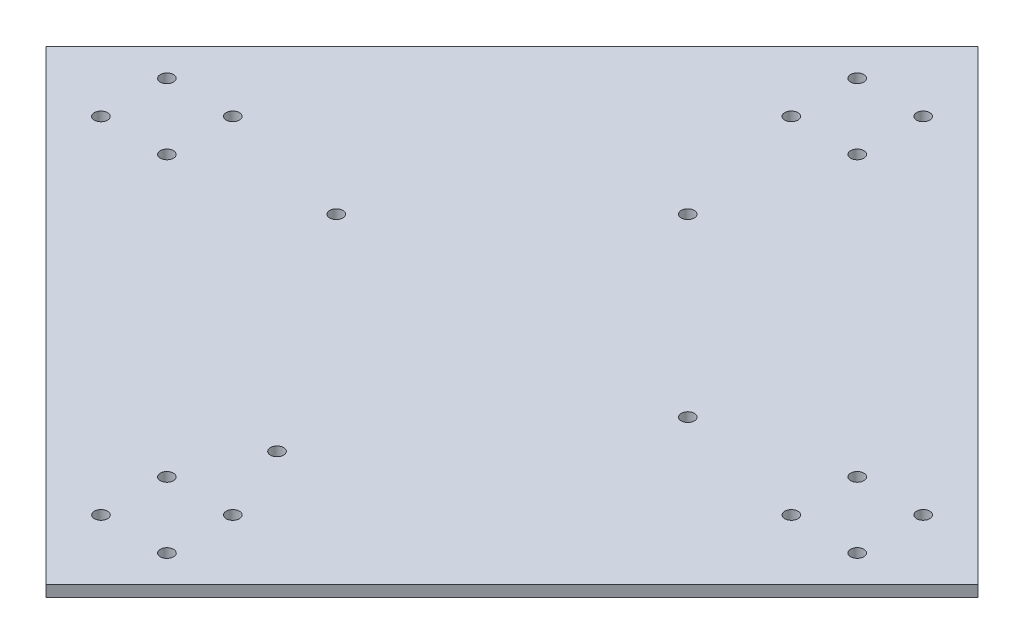
ISO-10303-21;
HEADER;
FILE_DESCRIPTION(('STEP AP214'),'2;1');
FILE_NAME('part.step','',(''),(''),'','','');
FILE_SCHEMA(('AUTOMOTIVE_DESIGN { 1 0 10303 214 1 1 1 1 }'));
ENDSEC;
DATA;
#1=APPLICATION_CONTEXT('core data for automotive mechanical design processes');
#2=APPLICATION_PROTOCOL_DEFINITION('international standard','automotive_design',2000,#1);
#3=PRODUCT_CONTEXT('',#1,'mechanical');
#4=PRODUCT('Part','Part','',(#3));
#5=PRODUCT_RELATED_PRODUCT_CATEGORY('part','',(#4));
#6=PRODUCT_DEFINITION_FORMATION('','',#4);
#7=PRODUCT_DEFINITION_CONTEXT('part definition',#1,'design');
#8=PRODUCT_DEFINITION('design','',#6,#7);
#9=PRODUCT_DEFINITION_SHAPE('','',#8);
#10=(LENGTH_UNIT() NAMED_UNIT(*) SI_UNIT(.MILLI.,.METRE.));
#11=(NAMED_UNIT(*) PLANE_ANGLE_UNIT() SI_UNIT($,.RADIAN.));
#12=(NAMED_UNIT(*) SI_UNIT($,.STERADIAN.) SOLID_ANGLE_UNIT());
#13=UNCERTAINTY_MEASURE_WITH_UNIT(LENGTH_MEASURE(1.E-05),#10,'distance_accuracy_value','');
#14=(GEOMETRIC_REPRESENTATION_CONTEXT(3) GLOBAL_UNCERTAINTY_ASSIGNED_CONTEXT((#13)) GLOBAL_UNIT_ASSIGNED_CONTEXT((#10,
#11,#12)) REPRESENTATION_CONTEXT('',''));
#15=CARTESIAN_POINT('',(0.,0.,0.));
#16=DIRECTION('',(0.,0.,1.));
#17=DIRECTION('',(1.,0.,0.));
#18=AXIS2_PLACEMENT_3D('',#15,#16,#17);
#19=CARTESIAN_POINT('',(94506.6112620316,1251.25,-82102.2476133017));
#20=DIRECTION('',(0.707106781186548,0.,-0.707106781186548));
#21=DIRECTION('',(-0.707106781186548,0.,-0.707106781186548));
#22=AXIS2_PLACEMENT_3D('',#19,#20,#21);
#23=PLANE('',#22);
#24=DIRECTION('',(0.707106781186548,0.,0.707106781186548));
#25=VECTOR('',#24,1.);
#26=CARTESIAN_POINT('',(94506.6112620316,1248.75,-82102.2476133017));
#27=LINE('',#26,#25);
#28=CARTESIAN_POINT('',(94459.7851015823,1248.75,-82149.073773751));
#29=VERTEX_POINT('',#28);
#30=CARTESIAN_POINT('',(94565.8511187603,1248.75,-82043.007756573));
#31=VERTEX_POINT('',#30);
#32=EDGE_CURVE('E182',#29,#31,#27,.T.);
#33=ORIENTED_EDGE('',*,*,#32,.F.);
#34=DIRECTION('',(0.,-1.,0.));
#35=VECTOR('',#34,1.);
#36=CARTESIAN_POINT('',(94459.7851015823,1251.25,-82149.073773751));
#37=LINE('',#36,#35);
#38=CARTESIAN_POINT('',(94459.7851015823,1251.25,-82149.073773751));
#39=VERTEX_POINT('',#38);
#40=EDGE_CURVE('E11',#39,#29,#37,.T.);
#41=ORIENTED_EDGE('',*,*,#40,.F.);
#42=DIRECTION('',(0.707106781186548,0.,0.707106781186548));
#43=VECTOR('',#42,1.);
#44=CARTESIAN_POINT('',(94506.6112620316,1251.25,-82102.2476133017));
#45=LINE('',#44,#43);
#46=CARTESIAN_POINT('',(94565.8511187603,1251.25,-82043.007756573));
#47=VERTEX_POINT('',#46);
#48=EDGE_CURVE('E108',#39,#47,#45,.T.);
#49=ORIENTED_EDGE('',*,*,#48,.T.);
#50=DIRECTION('',(0.,-1.,0.));
#51=VECTOR('',#50,1.);
#52=CARTESIAN_POINT('',(94565.8511187603,1251.25,-82043.007756573));
#53=LINE('',#52,#51);
#54=EDGE_CURVE('E84',#47,#31,#53,.T.);
#55=ORIENTED_EDGE('',*,*,#54,.T.);
#56=EDGE_LOOP('',(#33,#41,#49,#55));
#57=FACE_BOUND('',#56,.T.);
#58=ADVANCED_FACE('F41',(#57),#23,.T.);
#59=CARTESIAN_POINT('',(94318.5015494397,1251.25,-82007.7902188667));
#60=DIRECTION('',(-0.707106788047674,0.,-0.707106774325421));
#61=DIRECTION('',(-0.707106774325421,0.,0.707106788047674));
#62=AXIS2_PLACEMENT_3D('',#59,#60,#61);
#63=PLANE('',#62);
#64=DIRECTION('',(0.707106774325421,0.,-0.707106788047674));
#65=VECTOR('',#64,1.);
#66=CARTESIAN_POINT('',(94318.5015494397,1248.75,-82007.7902188667));
#67=LINE('',#66,#65);
#68=CARTESIAN_POINT('',(94353.7190864626,1248.75,-82043.007756573));
#69=VERTEX_POINT('',#68);
#70=EDGE_CURVE('E96',#69,#29,#67,.T.);
#71=ORIENTED_EDGE('',*,*,#70,.F.);
#72=DIRECTION('',(0.,-1.,0.));
#73=VECTOR('',#72,1.);
#74=CARTESIAN_POINT('',(94353.7190864626,1251.25,-82043.007756573));
#75=LINE('',#74,#73);
#76=CARTESIAN_POINT('',(94353.7190864626,1251.25,-82043.007756573));
#77=VERTEX_POINT('',#76);
#78=EDGE_CURVE('E52',#77,#69,#75,.T.);
#79=ORIENTED_EDGE('',*,*,#78,.F.);
#80=DIRECTION('',(0.707106774325421,0.,-0.707106788047674));
#81=VECTOR('',#80,1.);
#82=CARTESIAN_POINT('',(94318.5015494397,1251.25,-82007.7902188667));
#83=LINE('',#82,#81);
#84=EDGE_CURVE('E94',#77,#39,#83,.T.);
#85=ORIENTED_EDGE('',*,*,#84,.T.);
#86=ORIENTED_EDGE('',*,*,#40,.T.);
#87=EDGE_LOOP('',(#71,#79,#85,#86));
#88=FACE_BOUND('',#87,.T.);
#89=ADVANCED_FACE('F92',(#88),#63,.T.);
#90=CARTESIAN_POINT('',(94400.5452458827,1251.25,-81996.1815971529));
#91=DIRECTION('',(0.707106781186548,0.,-0.707106781186548));
#92=DIRECTION('',(-0.707106781186548,0.,-0.707106781186548));
#93=AXIS2_PLACEMENT_3D('',#90,#91,#92);
#94=PLANE('',#93);
#95=DIRECTION('',(0.707106781186548,0.,0.707106781186548));
#96=VECTOR('',#95,1.);
#97=CARTESIAN_POINT('',(94400.5452458827,1248.75,-81996.1815971529));
#98=LINE('',#97,#96);
#99=CARTESIAN_POINT('',(94459.7998782573,1248.75,-81936.9269647783));
#100=VERTEX_POINT('',#99);
#101=EDGE_CURVE('E187',#69,#100,#98,.T.);
#102=ORIENTED_EDGE('',*,*,#101,.T.);
#103=DIRECTION('',(0.,-1.,0.));
#104=VECTOR('',#103,1.);
#105=CARTESIAN_POINT('',(94459.7998782573,1251.25,-81936.9269647783));
#106=LINE('',#105,#104);
#107=CARTESIAN_POINT('',(94459.7998782573,1251.25,-81936.9269647783));
#108=VERTEX_POINT('',#107);
#109=EDGE_CURVE('E100',#108,#100,#106,.T.);
#110=ORIENTED_EDGE('',*,*,#109,.F.);
#111=DIRECTION('',(0.707106781186548,0.,0.707106781186548));
#112=VECTOR('',#111,1.);
#113=CARTESIAN_POINT('',(94400.5452458827,1251.25,-81996.1815971529));
#114=LINE('',#113,#112);
#115=EDGE_CURVE('E103',#77,#108,#114,.T.);
#116=ORIENTED_EDGE('',*,*,#115,.F.);
#117=ORIENTED_EDGE('',*,*,#78,.T.);
#118=EDGE_LOOP('',(#102,#110,#116,#117));
#119=FACE_BOUND('',#118,.T.);
#120=ADVANCED_FACE('F104',(#119),#94,.F.);
#121=CARTESIAN_POINT('',(94452.2851036406,1251.25,-82129.073773751));
#122=DIRECTION('',(0.,-1.,0.));
#123=DIRECTION('',(0.,0.,-1.));
#124=AXIS2_PLACEMENT_3D('',#121,#122,#123);
#125=CYLINDRICAL_SURFACE('',#124,1.49999999999997);
#126=CARTESIAN_POINT('',(94452.2851036406,1251.25,-82129.073773751));
#127=DIRECTION('',(0.,1.,0.));
#128=DIRECTION('',(0.,0.,1.));
#129=AXIS2_PLACEMENT_3D('',#126,#127,#128);
#130=CIRCLE('',#129,1.49999999999997);
#131=CARTESIAN_POINT('',(94452.2851036406,1251.25,-82127.573773751));
#132=VERTEX_POINT('',#131);
#133=EDGE_CURVE('E112',#132,#132,#130,.T.);
#134=ORIENTED_EDGE('',*,*,#133,.T.);
#135=EDGE_LOOP('',(#134));
#136=FACE_BOUND('',#135,.T.);
#137=CARTESIAN_POINT('',(94452.2851036406,1248.75,-82129.073773751));
#138=DIRECTION('',(0.,1.,0.));
#139=DIRECTION('',(0.,0.,1.));
#140=AXIS2_PLACEMENT_3D('',#137,#138,#139);
#141=CIRCLE('',#140,1.49999999999997);
#142=CARTESIAN_POINT('',(94452.2851036406,1248.75,-82127.573773751));
#143=VERTEX_POINT('',#142);
#144=EDGE_CURVE('E178',#143,#143,#141,.T.);
#145=ORIENTED_EDGE('',*,*,#144,.F.);
#146=EDGE_LOOP('',(#145));
#147=FACE_BOUND('',#146,.T.);
#148=ADVANCED_FACE('F236',(#136,#147),#125,.F.);
#149=CARTESIAN_POINT('',(94467.2998782573,1251.25,-82129.073773751));
#150=DIRECTION('',(0.,-1.,0.));
#151=DIRECTION('',(0.,0.,-1.));
#152=AXIS2_PLACEMENT_3D('',#149,#150,#151);
#153=CYLINDRICAL_SURFACE('',#152,1.49999999999997);
#154=CARTESIAN_POINT('',(94467.2998782573,1251.25,-82129.073773751));
#155=DIRECTION('',(0.,1.,0.));
#156=DIRECTION('',(0.,0.,1.));
#157=AXIS2_PLACEMENT_3D('',#154,#155,#156);
#158=CIRCLE('',#157,1.49999999999997);
#159=CARTESIAN_POINT('',(94467.2998782573,1251.25,-82127.573773751));
#160=VERTEX_POINT('',#159);
#161=EDGE_CURVE('E555',#160,#160,#158,.T.);
#162=ORIENTED_EDGE('',*,*,#161,.T.);
#163=EDGE_LOOP('',(#162));
#164=FACE_BOUND('',#163,.T.);
#165=CARTESIAN_POINT('',(94467.2998782573,1248.75,-82129.073773751));
#166=DIRECTION('',(0.,1.,0.));
#167=DIRECTION('',(0.,0.,1.));
#168=AXIS2_PLACEMENT_3D('',#165,#166,#167);
#169=CIRCLE('',#168,1.49999999999997);
#170=CARTESIAN_POINT('',(94467.2998782573,1248.75,-82127.573773751));
#171=VERTEX_POINT('',#170);
#172=EDGE_CURVE('E174',#171,#171,#169,.T.);
#173=ORIENTED_EDGE('',*,*,#172,.F.);
#174=EDGE_LOOP('',(#173));
#175=FACE_BOUND('',#174,.T.);
#176=ADVANCED_FACE('F239',(#164,#175),#153,.F.);
#177=CARTESIAN_POINT('',(94467.2998782573,1251.25,-82114.073773751));
#178=DIRECTION('',(0.,-1.,0.));
#179=DIRECTION('',(0.,0.,-1.));
#180=AXIS2_PLACEMENT_3D('',#177,#178,#179);
#181=CYLINDRICAL_SURFACE('',#180,1.49999999999997);
#182=CARTESIAN_POINT('',(94467.2998782573,1251.25,-82114.073773751));
#183=DIRECTION('',(0.,1.,0.));
#184=DIRECTION('',(0.,0.,1.));
#185=AXIS2_PLACEMENT_3D('',#182,#183,#184);
#186=CIRCLE('',#185,1.49999999999997);
#187=CARTESIAN_POINT('',(94467.2998782573,1251.25,-82112.573773751));
#188=VERTEX_POINT('',#187);
#189=EDGE_CURVE('E551',#188,#188,#186,.T.);
#190=ORIENTED_EDGE('',*,*,#189,.T.);
#191=EDGE_LOOP('',(#190));
#192=FACE_BOUND('',#191,.T.);
#193=CARTESIAN_POINT('',(94467.2998782573,1248.75,-82114.073773751));
#194=DIRECTION('',(0.,1.,0.));
#195=DIRECTION('',(0.,0.,1.));
#196=AXIS2_PLACEMENT_3D('',#193,#194,#195);
#197=CIRCLE('',#196,1.49999999999997);
#198=CARTESIAN_POINT('',(94467.2998782573,1248.75,-82112.573773751));
#199=VERTEX_POINT('',#198);
#200=EDGE_CURVE('E170',#199,#199,#197,.T.);
#201=ORIENTED_EDGE('',*,*,#200,.F.);
#202=EDGE_LOOP('',(#201));
#203=FACE_BOUND('',#202,.T.);
#204=ADVANCED_FACE('F243',(#192,#203),#181,.F.);
#205=CARTESIAN_POINT('',(94452.2998782573,1251.25,-82114.073773751));
#206=DIRECTION('',(0.,-1.,0.));
#207=DIRECTION('',(0.,0.,-1.));
#208=AXIS2_PLACEMENT_3D('',#205,#206,#207);
#209=CYLINDRICAL_SURFACE('',#208,1.49999999999997);
#210=CARTESIAN_POINT('',(94452.2998782573,1251.25,-82114.073773751));
#211=DIRECTION('',(0.,1.,0.));
#212=DIRECTION('',(0.,0.,1.));
#213=AXIS2_PLACEMENT_3D('',#210,#211,#212);
#214=CIRCLE('',#213,1.49999999999997);
#215=CARTESIAN_POINT('',(94452.2998782573,1251.25,-82112.573773751));
#216=VERTEX_POINT('',#215);
#217=EDGE_CURVE('E547',#216,#216,#214,.T.);
#218=ORIENTED_EDGE('',*,*,#217,.T.);
#219=EDGE_LOOP('',(#218));
#220=FACE_BOUND('',#219,.T.);
#221=CARTESIAN_POINT('',(94452.2998782573,1248.75,-82114.073773751));
#222=DIRECTION('',(0.,1.,0.));
#223=DIRECTION('',(0.,0.,1.));
#224=AXIS2_PLACEMENT_3D('',#221,#222,#223);
#225=CIRCLE('',#224,1.49999999999997);
#226=CARTESIAN_POINT('',(94452.2998782573,1248.75,-82112.573773751));
#227=VERTEX_POINT('',#226);
#228=EDGE_CURVE('E166',#227,#227,#225,.T.);
#229=ORIENTED_EDGE('',*,*,#228,.F.);
#230=EDGE_LOOP('',(#229));
#231=FACE_BOUND('',#230,.T.);
#232=ADVANCED_FACE('F247',(#220,#231),#209,.F.);
#233=CARTESIAN_POINT('',(94530.8658954353,1251.25,-82035.507756573));
#234=DIRECTION('',(0.,-1.,0.));
#235=DIRECTION('',(0.,0.,-1.));
#236=AXIS2_PLACEMENT_3D('',#233,#234,#235);
#237=CYLINDRICAL_SURFACE('',#236,1.49999999999997);
#238=CARTESIAN_POINT('',(94530.8658954353,1251.25,-82035.507756573));
#239=DIRECTION('',(0.,1.,0.));
#240=DIRECTION('',(0.,0.,1.));
#241=AXIS2_PLACEMENT_3D('',#238,#239,#240);
#242=CIRCLE('',#241,1.49999999999997);
#243=CARTESIAN_POINT('',(94530.8658954353,1251.25,-82034.007756573));
#244=VERTEX_POINT('',#243);
#245=EDGE_CURVE('E543',#244,#244,#242,.T.);
#246=ORIENTED_EDGE('',*,*,#245,.T.);
#247=EDGE_LOOP('',(#246));
#248=FACE_BOUND('',#247,.T.);
#249=CARTESIAN_POINT('',(94530.8658954353,1248.75,-82035.507756573));
#250=DIRECTION('',(0.,1.,0.));
#251=DIRECTION('',(0.,0.,1.));
#252=AXIS2_PLACEMENT_3D('',#249,#250,#251);
#253=CIRCLE('',#252,1.49999999999997);
#254=CARTESIAN_POINT('',(94530.8658954353,1248.75,-82034.007756573));
#255=VERTEX_POINT('',#254);
#256=EDGE_CURVE('E162',#255,#255,#253,.T.);
#257=ORIENTED_EDGE('',*,*,#256,.F.);
#258=EDGE_LOOP('',(#257));
#259=FACE_BOUND('',#258,.T.);
#260=ADVANCED_FACE('F251',(#248,#259),#237,.F.);
#261=CARTESIAN_POINT('',(94452.2998782573,1251.25,-81971.941739395));
#262=DIRECTION('',(0.,-1.,0.));
#263=DIRECTION('',(0.,0.,-1.));
#264=AXIS2_PLACEMENT_3D('',#261,#262,#263);
#265=CYLINDRICAL_SURFACE('',#264,1.49999999999997);
#266=CARTESIAN_POINT('',(94452.2998782573,1251.25,-81971.941739395));
#267=DIRECTION('',(0.,1.,0.));
#268=DIRECTION('',(0.,0.,1.));
#269=AXIS2_PLACEMENT_3D('',#266,#267,#268);
#270=CIRCLE('',#269,1.49999999999997);
#271=CARTESIAN_POINT('',(94452.2998782573,1251.25,-81970.441739395));
#272=VERTEX_POINT('',#271);
#273=EDGE_CURVE('E539',#272,#272,#270,.T.);
#274=ORIENTED_EDGE('',*,*,#273,.T.);
#275=EDGE_LOOP('',(#274));
#276=FACE_BOUND('',#275,.T.);
#277=CARTESIAN_POINT('',(94452.2998782573,1248.75,-81971.941739395));
#278=DIRECTION('',(0.,1.,0.));
#279=DIRECTION('',(0.,0.,1.));
#280=AXIS2_PLACEMENT_3D('',#277,#278,#279);
#281=CIRCLE('',#280,1.49999999999997);
#282=CARTESIAN_POINT('',(94452.2998782573,1248.75,-81970.441739395));
#283=VERTEX_POINT('',#282);
#284=EDGE_CURVE('E158',#283,#283,#281,.T.);
#285=ORIENTED_EDGE('',*,*,#284,.F.);
#286=EDGE_LOOP('',(#285));
#287=FACE_BOUND('',#286,.T.);
#288=ADVANCED_FACE('F255',(#276,#287),#265,.F.);
#289=CARTESIAN_POINT('',(94388.7338610794,1251.25,-82050.507756573));
#290=DIRECTION('',(0.,-1.,0.));
#291=DIRECTION('',(0.,0.,-1.));
#292=AXIS2_PLACEMENT_3D('',#289,#290,#291);
#293=CYLINDRICAL_SURFACE('',#292,1.49999999999997);
#294=CARTESIAN_POINT('',(94388.7338610794,1251.25,-82050.507756573));
#295=DIRECTION('',(0.,1.,0.));
#296=DIRECTION('',(0.,0.,1.));
#297=AXIS2_PLACEMENT_3D('',#294,#295,#296);
#298=CIRCLE('',#297,1.49999999999997);
#299=CARTESIAN_POINT('',(94388.7338610794,1251.25,-82049.007756573));
#300=VERTEX_POINT('',#299);
#301=EDGE_CURVE('E535',#300,#300,#298,.T.);
#302=ORIENTED_EDGE('',*,*,#301,.T.);
#303=EDGE_LOOP('',(#302));
#304=FACE_BOUND('',#303,.T.);
#305=CARTESIAN_POINT('',(94388.7338610794,1248.75,-82050.507756573));
#306=DIRECTION('',(0.,1.,0.));
#307=DIRECTION('',(0.,0.,1.));
#308=AXIS2_PLACEMENT_3D('',#305,#306,#307);
#309=CIRCLE('',#308,1.49999999999997);
#310=CARTESIAN_POINT('',(94388.7338610794,1248.75,-82049.007756573));
#311=VERTEX_POINT('',#310);
#312=EDGE_CURVE('E154',#311,#311,#309,.T.);
#313=ORIENTED_EDGE('',*,*,#312,.F.);
#314=EDGE_LOOP('',(#313));
#315=FACE_BOUND('',#314,.T.);
#316=ADVANCED_FACE('F259',(#304,#315),#293,.F.);
#317=CARTESIAN_POINT('',(94545.8658954353,1251.25,-82050.5225311897));
#318=DIRECTION('',(0.,-1.,0.));
#319=DIRECTION('',(0.,0.,-1.));
#320=AXIS2_PLACEMENT_3D('',#317,#318,#319);
#321=CYLINDRICAL_SURFACE('',#320,1.49999999999997);
#322=CARTESIAN_POINT('',(94545.8658954353,1251.25,-82050.5225311897));
#323=DIRECTION('',(0.,1.,0.));
#324=DIRECTION('',(0.,0.,1.));
#325=AXIS2_PLACEMENT_3D('',#322,#323,#324);
#326=CIRCLE('',#325,1.49999999999997);
#327=CARTESIAN_POINT('',(94545.8658954353,1251.25,-82049.0225311898));
#328=VERTEX_POINT('',#327);
#329=EDGE_CURVE('E531',#328,#328,#326,.T.);
#330=ORIENTED_EDGE('',*,*,#329,.T.);
#331=EDGE_LOOP('',(#330));
#332=FACE_BOUND('',#331,.T.);
#333=CARTESIAN_POINT('',(94545.8658954353,1248.75,-82050.5225311897));
#334=DIRECTION('',(0.,1.,0.));
#335=DIRECTION('',(0.,0.,1.));
#336=AXIS2_PLACEMENT_3D('',#333,#334,#335);
#337=CIRCLE('',#336,1.49999999999997);
#338=CARTESIAN_POINT('',(94545.8658954353,1248.75,-82049.0225311898));
#339=VERTEX_POINT('',#338);
#340=EDGE_CURVE('E150',#339,#339,#337,.T.);
#341=ORIENTED_EDGE('',*,*,#340,.F.);
#342=EDGE_LOOP('',(#341));
#343=FACE_BOUND('',#342,.T.);
#344=ADVANCED_FACE('F263',(#332,#343),#321,.F.);
#345=CARTESIAN_POINT('',(94545.8658954353,1251.25,-82035.507756573));
#346=DIRECTION('',(0.,-1.,0.));
#347=DIRECTION('',(0.,0.,-1.));
#348=AXIS2_PLACEMENT_3D('',#345,#346,#347);
#349=CYLINDRICAL_SURFACE('',#348,1.49999999999997);
#350=CARTESIAN_POINT('',(94545.8658954353,1251.25,-82035.507756573));
#351=DIRECTION('',(0.,1.,0.));
#352=DIRECTION('',(0.,0.,1.));
#353=AXIS2_PLACEMENT_3D('',#350,#351,#352);
#354=CIRCLE('',#353,1.49999999999997);
#355=CARTESIAN_POINT('',(94545.8658954353,1251.25,-82034.007756573));
#356=VERTEX_POINT('',#355);
#357=EDGE_CURVE('E527',#356,#356,#354,.T.);
#358=ORIENTED_EDGE('',*,*,#357,.T.);
#359=EDGE_LOOP('',(#358));
#360=FACE_BOUND('',#359,.T.);
#361=CARTESIAN_POINT('',(94545.8658954353,1248.75,-82035.507756573));
#362=DIRECTION('',(0.,1.,0.));
#363=DIRECTION('',(0.,0.,1.));
#364=AXIS2_PLACEMENT_3D('',#361,#362,#363);
#365=CIRCLE('',#364,1.49999999999997);
#366=CARTESIAN_POINT('',(94545.8658954353,1248.75,-82034.007756573));
#367=VERTEX_POINT('',#366);
#368=EDGE_CURVE('E146',#367,#367,#365,.T.);
#369=ORIENTED_EDGE('',*,*,#368,.F.);
#370=EDGE_LOOP('',(#369));
#371=FACE_BOUND('',#370,.T.);
#372=ADVANCED_FACE('F267',(#360,#371),#349,.F.);
#373=CARTESIAN_POINT('',(94530.8658954353,1251.25,-82050.507756573));
#374=DIRECTION('',(0.,-1.,0.));
#375=DIRECTION('',(0.,0.,-1.));
#376=AXIS2_PLACEMENT_3D('',#373,#374,#375);
#377=CYLINDRICAL_SURFACE('',#376,1.49999999999997);
#378=CARTESIAN_POINT('',(94530.8658954353,1251.25,-82050.507756573));
#379=DIRECTION('',(0.,1.,0.));
#380=DIRECTION('',(0.,0.,1.));
#381=AXIS2_PLACEMENT_3D('',#378,#379,#380);
#382=CIRCLE('',#381,1.49999999999997);
#383=CARTESIAN_POINT('',(94530.8658954353,1251.25,-82049.007756573));
#384=VERTEX_POINT('',#383);
#385=EDGE_CURVE('E523',#384,#384,#382,.T.);
#386=ORIENTED_EDGE('',*,*,#385,.T.);
#387=EDGE_LOOP('',(#386));
#388=FACE_BOUND('',#387,.T.);
#389=CARTESIAN_POINT('',(94530.8658954353,1248.75,-82050.507756573));
#390=DIRECTION('',(0.,1.,0.));
#391=DIRECTION('',(0.,0.,1.));
#392=AXIS2_PLACEMENT_3D('',#389,#390,#391);
#393=CIRCLE('',#392,1.49999999999997);
#394=CARTESIAN_POINT('',(94530.8658954353,1248.75,-82049.007756573));
#395=VERTEX_POINT('',#394);
#396=EDGE_CURVE('E142',#395,#395,#393,.T.);
#397=ORIENTED_EDGE('',*,*,#396,.F.);
#398=EDGE_LOOP('',(#397));
#399=FACE_BOUND('',#398,.T.);
#400=ADVANCED_FACE('F271',(#388,#399),#377,.F.);
#401=CARTESIAN_POINT('',(94467.314652874,1251.25,-81956.941739395));
#402=DIRECTION('',(0.,-1.,0.));
#403=DIRECTION('',(0.,0.,-1.));
#404=AXIS2_PLACEMENT_3D('',#401,#402,#403);
#405=CYLINDRICAL_SURFACE('',#404,1.49999999999996);
#406=CARTESIAN_POINT('',(94467.314652874,1251.25,-81956.941739395));
#407=DIRECTION('',(0.,1.,0.));
#408=DIRECTION('',(0.,0.,1.));
#409=AXIS2_PLACEMENT_3D('',#406,#407,#408);
#410=CIRCLE('',#409,1.49999999999996);
#411=CARTESIAN_POINT('',(94467.314652874,1251.25,-81955.441739395));
#412=VERTEX_POINT('',#411);
#413=EDGE_CURVE('E519',#412,#412,#410,.T.);
#414=ORIENTED_EDGE('',*,*,#413,.T.);
#415=EDGE_LOOP('',(#414));
#416=FACE_BOUND('',#415,.T.);
#417=CARTESIAN_POINT('',(94467.314652874,1248.75,-81956.941739395));
#418=DIRECTION('',(0.,1.,0.));
#419=DIRECTION('',(0.,0.,1.));
#420=AXIS2_PLACEMENT_3D('',#417,#418,#419);
#421=CIRCLE('',#420,1.49999999999996);
#422=CARTESIAN_POINT('',(94467.314652874,1248.75,-81955.441739395));
#423=VERTEX_POINT('',#422);
#424=EDGE_CURVE('E138',#423,#423,#421,.T.);
#425=ORIENTED_EDGE('',*,*,#424,.F.);
#426=EDGE_LOOP('',(#425));
#427=FACE_BOUND('',#426,.T.);
#428=ADVANCED_FACE('F275',(#416,#427),#405,.F.);
#429=CARTESIAN_POINT('',(94452.2998782573,1251.25,-81956.941739395));
#430=DIRECTION('',(0.,-1.,0.));
#431=DIRECTION('',(0.,0.,-1.));
#432=AXIS2_PLACEMENT_3D('',#429,#430,#431);
#433=CYLINDRICAL_SURFACE('',#432,1.49999999999997);
#434=CARTESIAN_POINT('',(94452.2998782573,1251.25,-81956.941739395));
#435=DIRECTION('',(0.,1.,0.));
#436=DIRECTION('',(0.,0.,1.));
#437=AXIS2_PLACEMENT_3D('',#434,#435,#436);
#438=CIRCLE('',#437,1.49999999999997);
#439=CARTESIAN_POINT('',(94452.2998782573,1251.25,-81955.441739395));
#440=VERTEX_POINT('',#439);
#441=EDGE_CURVE('E515',#440,#440,#438,.T.);
#442=ORIENTED_EDGE('',*,*,#441,.T.);
#443=EDGE_LOOP('',(#442));
#444=FACE_BOUND('',#443,.T.);
#445=CARTESIAN_POINT('',(94452.2998782573,1248.75,-81956.941739395));
#446=DIRECTION('',(0.,1.,0.));
#447=DIRECTION('',(0.,0.,1.));
#448=AXIS2_PLACEMENT_3D('',#445,#446,#447);
#449=CIRCLE('',#448,1.49999999999997);
#450=CARTESIAN_POINT('',(94452.2998782573,1248.75,-81955.441739395));
#451=VERTEX_POINT('',#450);
#452=EDGE_CURVE('E134',#451,#451,#449,.T.);
#453=ORIENTED_EDGE('',*,*,#452,.F.);
#454=EDGE_LOOP('',(#453));
#455=FACE_BOUND('',#454,.T.);
#456=ADVANCED_FACE('F279',(#444,#455),#433,.F.);
#457=CARTESIAN_POINT('',(94467.2998782573,1251.25,-81971.941739395));
#458=DIRECTION('',(0.,-1.,0.));
#459=DIRECTION('',(0.,0.,-1.));
#460=AXIS2_PLACEMENT_3D('',#457,#458,#459);
#461=CYLINDRICAL_SURFACE('',#460,1.49999999999996);
#462=CARTESIAN_POINT('',(94467.2998782573,1251.25,-81971.941739395));
#463=DIRECTION('',(0.,1.,0.));
#464=DIRECTION('',(0.,0.,1.));
#465=AXIS2_PLACEMENT_3D('',#462,#463,#464);
#466=CIRCLE('',#465,1.49999999999996);
#467=CARTESIAN_POINT('',(94467.2998782573,1251.25,-81970.441739395));
#468=VERTEX_POINT('',#467);
#469=EDGE_CURVE('E511',#468,#468,#466,.T.);
#470=ORIENTED_EDGE('',*,*,#469,.T.);
#471=EDGE_LOOP('',(#470));
#472=FACE_BOUND('',#471,.T.);
#473=CARTESIAN_POINT('',(94467.2998782573,1248.75,-81971.941739395));
#474=DIRECTION('',(0.,1.,0.));
#475=DIRECTION('',(0.,0.,1.));
#476=AXIS2_PLACEMENT_3D('',#473,#474,#475);
#477=CIRCLE('',#476,1.49999999999996);
#478=CARTESIAN_POINT('',(94467.2998782573,1248.75,-81970.441739395));
#479=VERTEX_POINT('',#478);
#480=EDGE_CURVE('E130',#479,#479,#477,.T.);
#481=ORIENTED_EDGE('',*,*,#480,.F.);
#482=EDGE_LOOP('',(#481));
#483=FACE_BOUND('',#482,.T.);
#484=ADVANCED_FACE('F283',(#472,#483),#461,.F.);
#485=CARTESIAN_POINT('',(94373.7338610793,1251.25,-82035.4929819563));
#486=DIRECTION('',(0.,-1.,0.));
#487=DIRECTION('',(0.,0.,-1.));
#488=AXIS2_PLACEMENT_3D('',#485,#486,#487);
#489=CYLINDRICAL_SURFACE('',#488,1.49999999999996);
#490=CARTESIAN_POINT('',(94373.7338610793,1251.25,-82035.4929819563));
#491=DIRECTION('',(0.,1.,0.));
#492=DIRECTION('',(0.,0.,1.));
#493=AXIS2_PLACEMENT_3D('',#490,#491,#492);
#494=CIRCLE('',#493,1.49999999999996);
#495=CARTESIAN_POINT('',(94373.7338610793,1251.25,-82033.9929819563));
#496=VERTEX_POINT('',#495);
#497=EDGE_CURVE('E507',#496,#496,#494,.T.);
#498=ORIENTED_EDGE('',*,*,#497,.T.);
#499=EDGE_LOOP('',(#498));
#500=FACE_BOUND('',#499,.T.);
#501=CARTESIAN_POINT('',(94373.7338610793,1248.75,-82035.4929819563));
#502=DIRECTION('',(0.,1.,0.));
#503=DIRECTION('',(0.,0.,1.));
#504=AXIS2_PLACEMENT_3D('',#501,#502,#503);
#505=CIRCLE('',#504,1.49999999999996);
#506=CARTESIAN_POINT('',(94373.7338610793,1248.75,-82033.9929819563));
#507=VERTEX_POINT('',#506);
#508=EDGE_CURVE('E126',#507,#507,#505,.T.);
#509=ORIENTED_EDGE('',*,*,#508,.F.);
#510=EDGE_LOOP('',(#509));
#511=FACE_BOUND('',#510,.T.);
#512=ADVANCED_FACE('F287',(#500,#511),#489,.F.);
#513=CARTESIAN_POINT('',(94373.7338610793,1251.25,-82050.507756573));
#514=DIRECTION('',(0.,-1.,0.));
#515=DIRECTION('',(0.,0.,-1.));
#516=AXIS2_PLACEMENT_3D('',#513,#514,#515);
#517=CYLINDRICAL_SURFACE('',#516,1.49999999999997);
#518=CARTESIAN_POINT('',(94373.7338610793,1251.25,-82050.507756573));
#519=DIRECTION('',(0.,1.,0.));
#520=DIRECTION('',(0.,0.,1.));
#521=AXIS2_PLACEMENT_3D('',#518,#519,#520);
#522=CIRCLE('',#521,1.49999999999997);
#523=CARTESIAN_POINT('',(94373.7338610793,1251.25,-82049.007756573));
#524=VERTEX_POINT('',#523);
#525=EDGE_CURVE('E302',#524,#524,#522,.T.);
#526=ORIENTED_EDGE('',*,*,#525,.T.);
#527=EDGE_LOOP('',(#526));
#528=FACE_BOUND('',#527,.T.);
#529=CARTESIAN_POINT('',(94373.7338610793,1248.75,-82050.507756573));
#530=DIRECTION('',(0.,1.,0.));
#531=DIRECTION('',(0.,0.,1.));
#532=AXIS2_PLACEMENT_3D('',#529,#530,#531);
#533=CIRCLE('',#532,1.49999999999997);
#534=CARTESIAN_POINT('',(94373.7338610793,1248.75,-82049.007756573));
#535=VERTEX_POINT('',#534);
#536=EDGE_CURVE('E122',#535,#535,#533,.T.);
#537=ORIENTED_EDGE('',*,*,#536,.F.);
#538=EDGE_LOOP('',(#537));
#539=FACE_BOUND('',#538,.T.);
#540=ADVANCED_FACE('F290',(#528,#539),#517,.F.);
#541=CARTESIAN_POINT('',(94388.7338610794,1251.25,-82035.507756573));
#542=DIRECTION('',(0.,-1.,0.));
#543=DIRECTION('',(0.,0.,-1.));
#544=AXIS2_PLACEMENT_3D('',#541,#542,#543);
#545=CYLINDRICAL_SURFACE('',#544,1.49999999999996);
#546=CARTESIAN_POINT('',(94388.7338610794,1251.25,-82035.507756573));
#547=DIRECTION('',(0.,1.,0.));
#548=DIRECTION('',(0.,0.,1.));
#549=AXIS2_PLACEMENT_3D('',#546,#547,#548);
#550=CIRCLE('',#549,1.49999999999996);
#551=CARTESIAN_POINT('',(94388.7338610794,1251.25,-82034.007756573));
#552=VERTEX_POINT('',#551);
#553=EDGE_CURVE('E192',#552,#552,#550,.T.);
#554=ORIENTED_EDGE('',*,*,#553,.T.);
#555=EDGE_LOOP('',(#554));
#556=FACE_BOUND('',#555,.T.);
#557=CARTESIAN_POINT('',(94388.7338610794,1248.75,-82035.507756573));
#558=DIRECTION('',(0.,1.,0.));
#559=DIRECTION('',(0.,0.,1.));
#560=AXIS2_PLACEMENT_3D('',#557,#558,#559);
#561=CIRCLE('',#560,1.49999999999996);
#562=CARTESIAN_POINT('',(94388.7338610794,1248.75,-82034.007756573));
#563=VERTEX_POINT('',#562);
#564=EDGE_CURVE('E118',#563,#563,#561,.T.);
#565=ORIENTED_EDGE('',*,*,#564,.F.);
#566=EDGE_LOOP('',(#565));
#567=FACE_BOUND('',#566,.T.);
#568=ADVANCED_FACE('F43',(#556,#567),#545,.F.);
#569=CARTESIAN_POINT('',(94424.5955014323,1251.25,-81901.712778216));
#570=DIRECTION('',(-0.707205278631363,0.,-0.707008270019479));
#571=DIRECTION('',(-0.707008270019479,0.,0.707205278631363));
#572=AXIS2_PLACEMENT_3D('',#569,#570,#571);
#573=PLANE('',#572);
#574=DIRECTION('',(0.707008270019479,0.,-0.707205278631363));
#575=VECTOR('',#574,1.);
#576=CARTESIAN_POINT('',(94424.5955014323,1248.75,-81901.712778216));
#577=LINE('',#576,#575);
#578=EDGE_CURVE('E77',#100,#31,#577,.T.);
#579=ORIENTED_EDGE('',*,*,#578,.T.);
#580=ORIENTED_EDGE('',*,*,#54,.F.);
#581=DIRECTION('',(0.707008270019479,0.,-0.707205278631363));
#582=VECTOR('',#581,1.);
#583=CARTESIAN_POINT('',(94424.5955014323,1251.25,-81901.712778216));
#584=LINE('',#583,#582);
#585=EDGE_CURVE('E61',#108,#47,#584,.T.);
#586=ORIENTED_EDGE('',*,*,#585,.F.);
#587=ORIENTED_EDGE('',*,*,#109,.T.);
#588=EDGE_LOOP('',(#579,#580,#586,#587));
#589=FACE_BOUND('',#588,.T.);
#590=ADVANCED_FACE('F297',(#589),#573,.F.);
#591=CARTESIAN_POINT('',(94365.3277089725,1251.25,-81960.9640602427));
#592=DIRECTION('',(0.,1.,0.));
#593=DIRECTION('',(0.,0.,1.));
#594=AXIS2_PLACEMENT_3D('',#591,#592,#593);
#595=PLANE('',#594);
#596=CARTESIAN_POINT('',(94459.7962156412,1251.25,-81989.5106696877));
#597=DIRECTION('',(0.,1.,0.));
#598=DIRECTION('',(0.,0.,1.));
#599=AXIS2_PLACEMENT_3D('',#596,#597,#598);
#600=CIRCLE('',#599,1.5);
#601=CARTESIAN_POINT('',(94459.7962156412,1251.25,-81988.0106696877));
#602=VERTEX_POINT('',#601);
#603=EDGE_CURVE('E202',#602,#602,#600,.T.);
#604=ORIENTED_EDGE('',*,*,#603,.F.);
#605=EDGE_LOOP('',(#604));
#606=FACE_BOUND('',#605,.T.);
#607=CARTESIAN_POINT('',(94419.7924059287,1251.25,-82043.007756573));
#608=DIRECTION('',(0.,1.,0.));
#609=DIRECTION('',(0.,0.,1.));
#610=AXIS2_PLACEMENT_3D('',#607,#608,#609);
#611=CIRCLE('',#610,1.5);
#612=CARTESIAN_POINT('',(94419.7924059287,1251.25,-82041.507756573));
#613=VERTEX_POINT('',#612);
#614=EDGE_CURVE('E491',#613,#613,#611,.T.);
#615=ORIENTED_EDGE('',*,*,#614,.F.);
#616=EDGE_LOOP('',(#615));
#617=FACE_BOUND('',#616,.T.);
#618=CARTESIAN_POINT('',(94459.7897032827,1251.25,-82083.007756573));
#619=DIRECTION('',(0.,1.,0.));
#620=DIRECTION('',(0.,0.,1.));
#621=AXIS2_PLACEMENT_3D('',#618,#619,#620);
#622=CIRCLE('',#621,1.5);
#623=CARTESIAN_POINT('',(94459.7897032827,1251.25,-82081.507756573));
#624=VERTEX_POINT('',#623);
#625=EDGE_CURVE('E480',#624,#624,#622,.T.);
#626=ORIENTED_EDGE('',*,*,#625,.F.);
#627=EDGE_LOOP('',(#626));
#628=FACE_BOUND('',#627,.T.);
#629=CARTESIAN_POINT('',(94499.7924059287,1251.25,-82043.007756573));
#630=DIRECTION('',(0.,1.,0.));
#631=DIRECTION('',(0.,0.,1.));
#632=AXIS2_PLACEMENT_3D('',#629,#630,#631);
#633=CIRCLE('',#632,1.50000000000001);
#634=CARTESIAN_POINT('',(94499.7924059287,1251.25,-82041.507756573));
#635=VERTEX_POINT('',#634);
#636=EDGE_CURVE('E492',#635,#635,#633,.T.);
#637=ORIENTED_EDGE('',*,*,#636,.F.);
#638=EDGE_LOOP('',(#637));
#639=FACE_BOUND('',#638,.T.);
#640=ORIENTED_EDGE('',*,*,#553,.F.);
#641=EDGE_LOOP('',(#640));
#642=FACE_BOUND('',#641,.T.);
#643=ORIENTED_EDGE('',*,*,#525,.F.);
#644=EDGE_LOOP('',(#643));
#645=FACE_BOUND('',#644,.T.);
#646=ORIENTED_EDGE('',*,*,#497,.F.);
#647=EDGE_LOOP('',(#646));
#648=FACE_BOUND('',#647,.T.);
#649=ORIENTED_EDGE('',*,*,#469,.F.);
#650=EDGE_LOOP('',(#649));
#651=FACE_BOUND('',#650,.T.);
#652=ORIENTED_EDGE('',*,*,#441,.F.);
#653=EDGE_LOOP('',(#652));
#654=FACE_BOUND('',#653,.T.);
#655=ORIENTED_EDGE('',*,*,#413,.F.);
#656=EDGE_LOOP('',(#655));
#657=FACE_BOUND('',#656,.T.);
#658=ORIENTED_EDGE('',*,*,#385,.F.);
#659=EDGE_LOOP('',(#658));
#660=FACE_BOUND('',#659,.T.);
#661=ORIENTED_EDGE('',*,*,#357,.F.);
#662=EDGE_LOOP('',(#661));
#663=FACE_BOUND('',#662,.T.);
#664=ORIENTED_EDGE('',*,*,#329,.F.);
#665=EDGE_LOOP('',(#664));
#666=FACE_BOUND('',#665,.T.);
#667=ORIENTED_EDGE('',*,*,#301,.F.);
#668=EDGE_LOOP('',(#667));
#669=FACE_BOUND('',#668,.T.);
#670=ORIENTED_EDGE('',*,*,#273,.F.);
#671=EDGE_LOOP('',(#670));
#672=FACE_BOUND('',#671,.T.);
#673=ORIENTED_EDGE('',*,*,#245,.F.);
#674=EDGE_LOOP('',(#673));
#675=FACE_BOUND('',#674,.T.);
#676=ORIENTED_EDGE('',*,*,#217,.F.);
#677=EDGE_LOOP('',(#676));
#678=FACE_BOUND('',#677,.T.);
#679=ORIENTED_EDGE('',*,*,#189,.F.);
#680=EDGE_LOOP('',(#679));
#681=FACE_BOUND('',#680,.T.);
#682=ORIENTED_EDGE('',*,*,#161,.F.);
#683=EDGE_LOOP('',(#682));
#684=FACE_BOUND('',#683,.T.);
#685=ORIENTED_EDGE('',*,*,#133,.F.);
#686=EDGE_LOOP('',(#685));
#687=FACE_BOUND('',#686,.T.);
#688=ORIENTED_EDGE('',*,*,#48,.F.);
#689=ORIENTED_EDGE('',*,*,#84,.F.);
#690=ORIENTED_EDGE('',*,*,#115,.T.);
#691=ORIENTED_EDGE('',*,*,#585,.T.);
#692=EDGE_LOOP('',(#688,#689,#690,#691));
#693=FACE_BOUND('',#692,.T.);
#694=ADVANCED_FACE('F107',(#606,#617,#628,#639,#642,#645,#648,#651,#654,#657,#660,#663,#666,
#669,#672,#675,#678,#681,#684,#687,#693),#595,.T.);
#695=CARTESIAN_POINT('',(94365.3277089725,1248.75,-81960.9640602427));
#696=DIRECTION('',(0.,1.,0.));
#697=DIRECTION('',(0.,0.,1.));
#698=AXIS2_PLACEMENT_3D('',#695,#696,#697);
#699=PLANE('',#698);
#700=CARTESIAN_POINT('',(94459.7962156412,1248.75,-81989.5106696877));
#701=DIRECTION('',(0.,1.,0.));
#702=DIRECTION('',(0.,0.,1.));
#703=AXIS2_PLACEMENT_3D('',#700,#701,#702);
#704=CIRCLE('',#703,1.5);
#705=CARTESIAN_POINT('',(94459.7962156412,1248.75,-81988.0106696877));
#706=VERTEX_POINT('',#705);
#707=EDGE_CURVE('E45',#706,#706,#704,.T.);
#708=ORIENTED_EDGE('',*,*,#707,.T.);
#709=EDGE_LOOP('',(#708));
#710=FACE_BOUND('',#709,.T.);
#711=CARTESIAN_POINT('',(94419.7924059287,1248.75,-82043.007756573));
#712=DIRECTION('',(0.,1.,0.));
#713=DIRECTION('',(0.,0.,1.));
#714=AXIS2_PLACEMENT_3D('',#711,#712,#713);
#715=CIRCLE('',#714,1.5);
#716=CARTESIAN_POINT('',(94419.7924059287,1248.75,-82041.507756573));
#717=VERTEX_POINT('',#716);
#718=EDGE_CURVE('E205',#717,#717,#715,.T.);
#719=ORIENTED_EDGE('',*,*,#718,.T.);
#720=EDGE_LOOP('',(#719));
#721=FACE_BOUND('',#720,.T.);
#722=CARTESIAN_POINT('',(94459.7897032827,1248.75,-82083.007756573));
#723=DIRECTION('',(0.,1.,0.));
#724=DIRECTION('',(0.,0.,1.));
#725=AXIS2_PLACEMENT_3D('',#722,#723,#724);
#726=CIRCLE('',#725,1.5);
#727=CARTESIAN_POINT('',(94459.7897032827,1248.75,-82081.507756573));
#728=VERTEX_POINT('',#727);
#729=EDGE_CURVE('E201',#728,#728,#726,.T.);
#730=ORIENTED_EDGE('',*,*,#729,.T.);
#731=EDGE_LOOP('',(#730));
#732=FACE_BOUND('',#731,.T.);
#733=CARTESIAN_POINT('',(94499.7924059287,1248.75,-82043.007756573));
#734=DIRECTION('',(0.,1.,0.));
#735=DIRECTION('',(0.,0.,1.));
#736=AXIS2_PLACEMENT_3D('',#733,#734,#735);
#737=CIRCLE('',#736,1.50000000000001);
#738=CARTESIAN_POINT('',(94499.7924059287,1248.75,-82041.507756573));
#739=VERTEX_POINT('',#738);
#740=EDGE_CURVE('E197',#739,#739,#737,.T.);
#741=ORIENTED_EDGE('',*,*,#740,.T.);
#742=EDGE_LOOP('',(#741));
#743=FACE_BOUND('',#742,.T.);
#744=ORIENTED_EDGE('',*,*,#564,.T.);
#745=EDGE_LOOP('',(#744));
#746=FACE_BOUND('',#745,.T.);
#747=ORIENTED_EDGE('',*,*,#536,.T.);
#748=EDGE_LOOP('',(#747));
#749=FACE_BOUND('',#748,.T.);
#750=ORIENTED_EDGE('',*,*,#508,.T.);
#751=EDGE_LOOP('',(#750));
#752=FACE_BOUND('',#751,.T.);
#753=ORIENTED_EDGE('',*,*,#480,.T.);
#754=EDGE_LOOP('',(#753));
#755=FACE_BOUND('',#754,.T.);
#756=ORIENTED_EDGE('',*,*,#452,.T.);
#757=EDGE_LOOP('',(#756));
#758=FACE_BOUND('',#757,.T.);
#759=ORIENTED_EDGE('',*,*,#424,.T.);
#760=EDGE_LOOP('',(#759));
#761=FACE_BOUND('',#760,.T.);
#762=ORIENTED_EDGE('',*,*,#396,.T.);
#763=EDGE_LOOP('',(#762));
#764=FACE_BOUND('',#763,.T.);
#765=ORIENTED_EDGE('',*,*,#368,.T.);
#766=EDGE_LOOP('',(#765));
#767=FACE_BOUND('',#766,.T.);
#768=ORIENTED_EDGE('',*,*,#340,.T.);
#769=EDGE_LOOP('',(#768));
#770=FACE_BOUND('',#769,.T.);
#771=ORIENTED_EDGE('',*,*,#312,.T.);
#772=EDGE_LOOP('',(#771));
#773=FACE_BOUND('',#772,.T.);
#774=ORIENTED_EDGE('',*,*,#284,.T.);
#775=EDGE_LOOP('',(#774));
#776=FACE_BOUND('',#775,.T.);
#777=ORIENTED_EDGE('',*,*,#256,.T.);
#778=EDGE_LOOP('',(#777));
#779=FACE_BOUND('',#778,.T.);
#780=ORIENTED_EDGE('',*,*,#228,.T.);
#781=EDGE_LOOP('',(#780));
#782=FACE_BOUND('',#781,.T.);
#783=ORIENTED_EDGE('',*,*,#200,.T.);
#784=EDGE_LOOP('',(#783));
#785=FACE_BOUND('',#784,.T.);
#786=ORIENTED_EDGE('',*,*,#172,.T.);
#787=EDGE_LOOP('',(#786));
#788=FACE_BOUND('',#787,.T.);
#789=ORIENTED_EDGE('',*,*,#144,.T.);
#790=EDGE_LOOP('',(#789));
#791=FACE_BOUND('',#790,.T.);
#792=ORIENTED_EDGE('',*,*,#32,.T.);
#793=ORIENTED_EDGE('',*,*,#578,.F.);
#794=ORIENTED_EDGE('',*,*,#101,.F.);
#795=ORIENTED_EDGE('',*,*,#70,.T.);
#796=EDGE_LOOP('',(#792,#793,#794,#795));
#797=FACE_BOUND('',#796,.T.);
#798=ADVANCED_FACE('F214',(#710,#721,#732,#743,#746,#749,#752,#755,#758,#761,#764,#767,#770,
#773,#776,#779,#782,#785,#788,#791,#797),#699,.F.);
#799=CARTESIAN_POINT('',(94499.7924059287,1246.25,-82043.007756573));
#800=DIRECTION('',(0.,1.,0.));
#801=DIRECTION('',(0.,0.,1.));
#802=AXIS2_PLACEMENT_3D('',#799,#800,#801);
#803=CYLINDRICAL_SURFACE('',#802,1.50000000000001);
#804=ORIENTED_EDGE('',*,*,#636,.T.);
#805=EDGE_LOOP('',(#804));
#806=FACE_BOUND('',#805,.T.);
#807=ORIENTED_EDGE('',*,*,#740,.F.);
#808=EDGE_LOOP('',(#807));
#809=FACE_BOUND('',#808,.T.);
#810=ADVANCED_FACE('F307',(#806,#809),#803,.F.);
#811=CARTESIAN_POINT('',(94459.7897032827,1246.25,-82083.007756573));
#812=DIRECTION('',(0.,1.,0.));
#813=DIRECTION('',(0.,0.,1.));
#814=AXIS2_PLACEMENT_3D('',#811,#812,#813);
#815=CYLINDRICAL_SURFACE('',#814,1.5);
#816=ORIENTED_EDGE('',*,*,#625,.T.);
#817=EDGE_LOOP('',(#816));
#818=FACE_BOUND('',#817,.T.);
#819=ORIENTED_EDGE('',*,*,#729,.F.);
#820=EDGE_LOOP('',(#819));
#821=FACE_BOUND('',#820,.T.);
#822=ADVANCED_FACE('F224',(#818,#821),#815,.F.);
#823=CARTESIAN_POINT('',(94419.7924059287,1246.25,-82043.007756573));
#824=DIRECTION('',(0.,1.,0.));
#825=DIRECTION('',(0.,0.,1.));
#826=AXIS2_PLACEMENT_3D('',#823,#824,#825);
#827=CYLINDRICAL_SURFACE('',#826,1.5);
#828=ORIENTED_EDGE('',*,*,#614,.T.);
#829=EDGE_LOOP('',(#828));
#830=FACE_BOUND('',#829,.T.);
#831=ORIENTED_EDGE('',*,*,#718,.F.);
#832=EDGE_LOOP('',(#831));
#833=FACE_BOUND('',#832,.T.);
#834=ADVANCED_FACE('F218',(#830,#833),#827,.F.);
#835=CARTESIAN_POINT('',(94459.7962156412,1246.25,-81989.5106696877));
#836=DIRECTION('',(0.,1.,0.));
#837=DIRECTION('',(0.,0.,1.));
#838=AXIS2_PLACEMENT_3D('',#835,#836,#837);
#839=CYLINDRICAL_SURFACE('',#838,1.5);
#840=ORIENTED_EDGE('',*,*,#603,.T.);
#841=EDGE_LOOP('',(#840));
#842=FACE_BOUND('',#841,.T.);
#843=ORIENTED_EDGE('',*,*,#707,.F.);
#844=EDGE_LOOP('',(#843));
#845=FACE_BOUND('',#844,.T.);
#846=ADVANCED_FACE('F216',(#842,#845),#839,.F.);
#847=CLOSED_SHELL('',(#58,#89,#120,#148,#176,#204,#232,#260,#288,#316,#344,#372,#400,#428,#456,
#484,#512,#540,#568,#590,#694,#798,#810,#822,#834,#846));
#848=MANIFOLD_SOLID_BREP('B2',#847);
#849=ADVANCED_BREP_SHAPE_REPRESENTATION('',(#18,#848),#14);
#850=SHAPE_DEFINITION_REPRESENTATION(#9,#849);
ENDSEC;
END-ISO-10303-21;
